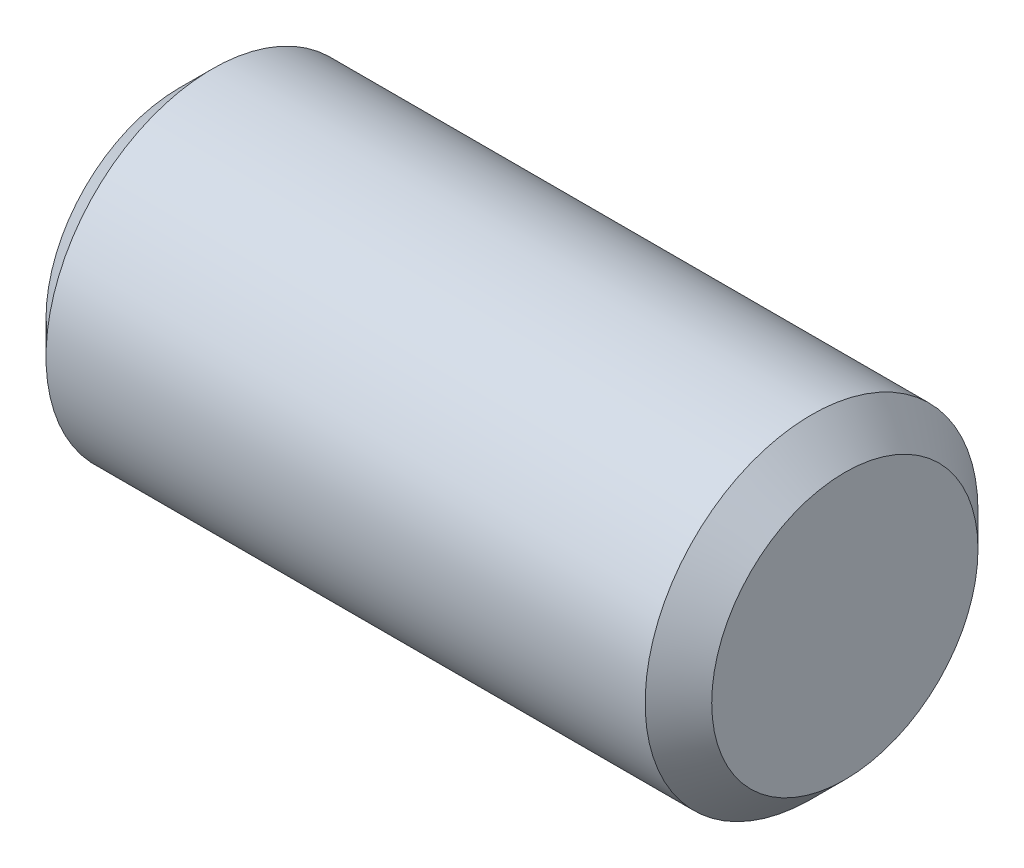
ISO-10303-21;
HEADER;
FILE_DESCRIPTION(('STEP AP214'),'2;1');
FILE_NAME('part.step','',(''),(''),'','','');
FILE_SCHEMA(('AUTOMOTIVE_DESIGN { 1 0 10303 214 1 1 1 1 }'));
ENDSEC;
DATA;
#1=APPLICATION_CONTEXT('core data for automotive mechanical design processes');
#2=APPLICATION_PROTOCOL_DEFINITION('international standard','automotive_design',2000,#1);
#3=PRODUCT_CONTEXT('',#1,'mechanical');
#4=PRODUCT('Part','Part','',(#3));
#5=PRODUCT_RELATED_PRODUCT_CATEGORY('part','',(#4));
#6=PRODUCT_DEFINITION_FORMATION('','',#4);
#7=PRODUCT_DEFINITION_CONTEXT('part definition',#1,'design');
#8=PRODUCT_DEFINITION('design','',#6,#7);
#9=PRODUCT_DEFINITION_SHAPE('','',#8);
#10=(LENGTH_UNIT() NAMED_UNIT(*) SI_UNIT(.MILLI.,.METRE.));
#11=(NAMED_UNIT(*) PLANE_ANGLE_UNIT() SI_UNIT($,.RADIAN.));
#12=(NAMED_UNIT(*) SI_UNIT($,.STERADIAN.) SOLID_ANGLE_UNIT());
#13=UNCERTAINTY_MEASURE_WITH_UNIT(LENGTH_MEASURE(1.E-05),#10,'distance_accuracy_value','');
#14=(GEOMETRIC_REPRESENTATION_CONTEXT(3) GLOBAL_UNCERTAINTY_ASSIGNED_CONTEXT((#13)) GLOBAL_UNIT_ASSIGNED_CONTEXT((#10,
#11,#12)) REPRESENTATION_CONTEXT('',''));
#15=CARTESIAN_POINT('',(0.,0.,0.));
#16=DIRECTION('',(0.,0.,1.));
#17=DIRECTION('',(1.,0.,0.));
#18=AXIS2_PLACEMENT_3D('',#15,#16,#17);
#19=CARTESIAN_POINT('',(-3.175,0.,0.));
#20=DIRECTION('',(1.,0.,0.));
#21=DIRECTION('',(0.,0.,-1.));
#22=AXIS2_PLACEMENT_3D('',#19,#20,#21);
#23=CYLINDRICAL_SURFACE('',#22,1.5875);
#24=CARTESIAN_POINT('',(2.8575,0.,0.));
#25=DIRECTION('',(1.,0.,0.));
#26=DIRECTION('',(0.,0.,-1.));
#27=AXIS2_PLACEMENT_3D('',#24,#25,#26);
#28=CIRCLE('',#27,1.5875);
#29=CARTESIAN_POINT('',(2.8575,0.,-1.5875));
#30=VERTEX_POINT('',#29);
#31=EDGE_CURVE('E39',#30,#30,#28,.F.);
#32=ORIENTED_EDGE('',*,*,#31,.T.);
#33=EDGE_LOOP('',(#32));
#34=FACE_BOUND('',#33,.T.);
#35=CARTESIAN_POINT('',(-2.8575,0.,0.));
#36=DIRECTION('',(1.,0.,0.));
#37=DIRECTION('',(0.,0.,-1.));
#38=AXIS2_PLACEMENT_3D('',#35,#36,#37);
#39=CIRCLE('',#38,1.5875);
#40=CARTESIAN_POINT('',(-2.8575,0.,-1.5875));
#41=VERTEX_POINT('',#40);
#42=EDGE_CURVE('E43',#41,#41,#39,.T.);
#43=ORIENTED_EDGE('',*,*,#42,.T.);
#44=EDGE_LOOP('',(#43));
#45=FACE_BOUND('',#44,.T.);
#46=ADVANCED_FACE('F32',(#34,#45),#23,.T.);
#47=CARTESIAN_POINT('',(-3.175,0.,0.));
#48=DIRECTION('',(1.,0.,0.));
#49=DIRECTION('',(0.,0.,-1.));
#50=AXIS2_PLACEMENT_3D('',#47,#48,#49);
#51=PLANE('',#50);
#52=CARTESIAN_POINT('',(-3.175,0.,0.));
#53=DIRECTION('',(1.,0.,0.));
#54=DIRECTION('',(0.,0.,-1.));
#55=AXIS2_PLACEMENT_3D('',#52,#53,#54);
#56=CIRCLE('',#55,1.27);
#57=CARTESIAN_POINT('',(-3.175,0.,-1.27));
#58=VERTEX_POINT('',#57);
#59=EDGE_CURVE('E10',#58,#58,#56,.F.);
#60=ORIENTED_EDGE('',*,*,#59,.T.);
#61=EDGE_LOOP('',(#60));
#62=FACE_BOUND('',#61,.T.);
#63=ADVANCED_FACE('F63',(#62),#51,.F.);
#64=CARTESIAN_POINT('',(3.175,0.,0.));
#65=DIRECTION('',(1.,0.,0.));
#66=DIRECTION('',(0.,0.,-1.));
#67=AXIS2_PLACEMENT_3D('',#64,#65,#66);
#68=PLANE('',#67);
#69=CARTESIAN_POINT('',(3.175,0.,0.));
#70=DIRECTION('',(1.,0.,0.));
#71=DIRECTION('',(0.,0.,-1.));
#72=AXIS2_PLACEMENT_3D('',#69,#70,#71);
#73=CIRCLE('',#72,1.27);
#74=CARTESIAN_POINT('',(3.175,0.,-1.27));
#75=VERTEX_POINT('',#74);
#76=EDGE_CURVE('E47',#75,#75,#73,.T.);
#77=ORIENTED_EDGE('',*,*,#76,.T.);
#78=EDGE_LOOP('',(#77));
#79=FACE_BOUND('',#78,.T.);
#80=ADVANCED_FACE('F53',(#79),#68,.T.);
#81=CARTESIAN_POINT('',(3.175,0.,0.));
#82=DIRECTION('',(-1.,0.,0.));
#83=DIRECTION('',(0.,0.,1.));
#84=AXIS2_PLACEMENT_3D('',#81,#82,#83);
#85=CONICAL_SURFACE('',#84,1.27,0.785398163397448);
#86=ORIENTED_EDGE('',*,*,#31,.F.);
#87=EDGE_LOOP('',(#86));
#88=FACE_BOUND('',#87,.T.);
#89=ORIENTED_EDGE('',*,*,#76,.F.);
#90=EDGE_LOOP('',(#89));
#91=FACE_BOUND('',#90,.T.);
#92=ADVANCED_FACE('F55',(#88,#91),#85,.T.);
#93=CARTESIAN_POINT('',(-2.8575,0.,0.));
#94=DIRECTION('',(1.,0.,0.));
#95=DIRECTION('',(0.,0.,-1.));
#96=AXIS2_PLACEMENT_3D('',#93,#94,#95);
#97=CONICAL_SURFACE('',#96,1.5875,0.78539816339745);
#98=ORIENTED_EDGE('',*,*,#59,.F.);
#99=EDGE_LOOP('',(#98));
#100=FACE_BOUND('',#99,.T.);
#101=ORIENTED_EDGE('',*,*,#42,.F.);
#102=EDGE_LOOP('',(#101));
#103=FACE_BOUND('',#102,.T.);
#104=ADVANCED_FACE('F34',(#100,#103),#97,.T.);
#105=CLOSED_SHELL('',(#46,#63,#80,#92,#104));
#106=MANIFOLD_SOLID_BREP('B2',#105);
#107=ADVANCED_BREP_SHAPE_REPRESENTATION('',(#18,#106),#14);
#108=SHAPE_DEFINITION_REPRESENTATION(#9,#107);
ENDSEC;
END-ISO-10303-21;
